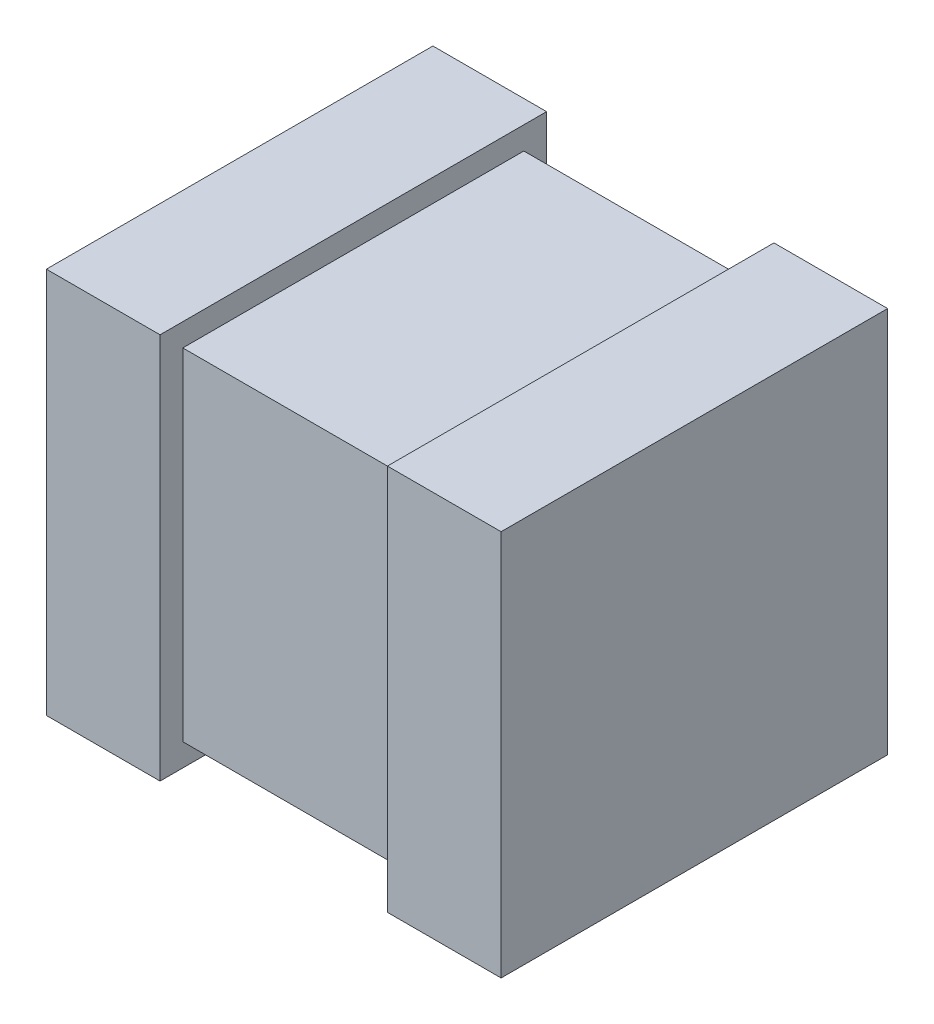
ISO-10303-21;
HEADER;
FILE_DESCRIPTION(('STEP AP214'),'2;1');
FILE_NAME('part.step','',(''),(''),'','','');
FILE_SCHEMA(('AUTOMOTIVE_DESIGN { 1 0 10303 214 1 1 1 1 }'));
ENDSEC;
DATA;
#1=APPLICATION_CONTEXT('core data for automotive mechanical design processes');
#2=APPLICATION_PROTOCOL_DEFINITION('international standard','automotive_design',2000,#1);
#3=PRODUCT_CONTEXT('',#1,'mechanical');
#4=PRODUCT('Part','Part','',(#3));
#5=PRODUCT_RELATED_PRODUCT_CATEGORY('part','',(#4));
#6=PRODUCT_DEFINITION_FORMATION('','',#4);
#7=PRODUCT_DEFINITION_CONTEXT('part definition',#1,'design');
#8=PRODUCT_DEFINITION('design','',#6,#7);
#9=PRODUCT_DEFINITION_SHAPE('','',#8);
#10=(LENGTH_UNIT() NAMED_UNIT(*) SI_UNIT(.MILLI.,.METRE.));
#11=(NAMED_UNIT(*) PLANE_ANGLE_UNIT() SI_UNIT($,.RADIAN.));
#12=(NAMED_UNIT(*) SI_UNIT($,.STERADIAN.) SOLID_ANGLE_UNIT());
#13=UNCERTAINTY_MEASURE_WITH_UNIT(LENGTH_MEASURE(1.E-05),#10,'distance_accuracy_value','');
#14=(GEOMETRIC_REPRESENTATION_CONTEXT(3) GLOBAL_UNCERTAINTY_ASSIGNED_CONTEXT((#13)) GLOBAL_UNIT_ASSIGNED_CONTEXT((#10,
#11,#12)) REPRESENTATION_CONTEXT('',''));
#15=CARTESIAN_POINT('',(0.,0.,0.));
#16=DIRECTION('',(0.,0.,1.));
#17=DIRECTION('',(1.,0.,0.));
#18=AXIS2_PLACEMENT_3D('',#15,#16,#17);
#19=CARTESIAN_POINT('',(-0.507999999999999,-0.381,0.762));
#20=DIRECTION('',(0.,1.,0.));
#21=DIRECTION('',(0.,0.,1.));
#22=AXIS2_PLACEMENT_3D('',#19,#20,#21);
#23=PLANE('',#22);
#24=DIRECTION('',(1.,0.,0.));
#25=VECTOR('',#24,1.);
#26=CARTESIAN_POINT('',(-0.507999999999999,-0.381,0.762));
#27=LINE('',#26,#25);
#28=CARTESIAN_POINT('',(-0.253999999999999,-0.381,0.762));
#29=VERTEX_POINT('',#28);
#30=CARTESIAN_POINT('',(0.254000000000001,-0.381,0.762));
#31=VERTEX_POINT('',#30);
#32=EDGE_CURVE('E214',#29,#31,#27,.T.);
#33=ORIENTED_EDGE('',*,*,#32,.F.);
#34=DIRECTION('',(0.,0.,-1.));
#35=VECTOR('',#34,1.);
#36=CARTESIAN_POINT('',(-0.253999999999999,-0.381,0.762));
#37=LINE('',#36,#35);
#38=CARTESIAN_POINT('',(-0.253999999999999,-0.381,0.));
#39=VERTEX_POINT('',#38);
#40=EDGE_CURVE('E169',#29,#39,#37,.T.);
#41=ORIENTED_EDGE('',*,*,#40,.T.);
#42=DIRECTION('',(1.,0.,0.));
#43=VECTOR('',#42,1.);
#44=CARTESIAN_POINT('',(-0.507999999999999,-0.381,0.));
#45=LINE('',#44,#43);
#46=CARTESIAN_POINT('',(0.254000000000001,-0.381,0.));
#47=VERTEX_POINT('',#46);
#48=EDGE_CURVE('E215',#39,#47,#45,.T.);
#49=ORIENTED_EDGE('',*,*,#48,.T.);
#50=DIRECTION('',(0.,0.,-1.));
#51=VECTOR('',#50,1.);
#52=CARTESIAN_POINT('',(0.254000000000001,-0.381,0.762));
#53=LINE('',#52,#51);
#54=EDGE_CURVE('E205',#31,#47,#53,.T.);
#55=ORIENTED_EDGE('',*,*,#54,.F.);
#56=EDGE_LOOP('',(#33,#41,#49,#55));
#57=FACE_BOUND('',#56,.T.);
#58=ADVANCED_FACE('F35',(#57),#23,.F.);
#59=CARTESIAN_POINT('',(0.508000000000001,0.381,0.762));
#60=DIRECTION('',(0.,-1.,0.));
#61=DIRECTION('',(1.,0.,0.));
#62=AXIS2_PLACEMENT_3D('',#59,#60,#61);
#63=PLANE('',#62);
#64=DIRECTION('',(-1.,0.,0.));
#65=VECTOR('',#64,1.);
#66=CARTESIAN_POINT('',(0.508000000000001,0.381,0.));
#67=LINE('',#66,#65);
#68=CARTESIAN_POINT('',(0.254000000000001,0.381,0.));
#69=VERTEX_POINT('',#68);
#70=CARTESIAN_POINT('',(-0.253999999999999,0.381,0.));
#71=VERTEX_POINT('',#70);
#72=EDGE_CURVE('E211',#69,#71,#67,.T.);
#73=ORIENTED_EDGE('',*,*,#72,.T.);
#74=DIRECTION('',(0.,0.,1.));
#75=VECTOR('',#74,1.);
#76=CARTESIAN_POINT('',(-0.253999999999999,0.381,0.762));
#77=LINE('',#76,#75);
#78=CARTESIAN_POINT('',(-0.253999999999999,0.381,0.762));
#79=VERTEX_POINT('',#78);
#80=EDGE_CURVE('E58',#71,#79,#77,.T.);
#81=ORIENTED_EDGE('',*,*,#80,.T.);
#82=DIRECTION('',(-1.,0.,0.));
#83=VECTOR('',#82,1.);
#84=CARTESIAN_POINT('',(0.508000000000001,0.381,0.762));
#85=LINE('',#84,#83);
#86=CARTESIAN_POINT('',(0.254000000000001,0.381,0.762));
#87=VERTEX_POINT('',#86);
#88=EDGE_CURVE('E212',#87,#79,#85,.T.);
#89=ORIENTED_EDGE('',*,*,#88,.F.);
#90=DIRECTION('',(0.,0.,1.));
#91=VECTOR('',#90,1.);
#92=CARTESIAN_POINT('',(0.254000000000001,0.381,0.762));
#93=LINE('',#92,#91);
#94=EDGE_CURVE('E203',#69,#87,#93,.T.);
#95=ORIENTED_EDGE('',*,*,#94,.F.);
#96=EDGE_LOOP('',(#73,#81,#89,#95));
#97=FACE_BOUND('',#96,.T.);
#98=ADVANCED_FACE('F227',(#97),#63,.F.);
#99=CARTESIAN_POINT('',(-0.507999999999999,-0.381,0.762));
#100=DIRECTION('',(0.,0.,-1.));
#101=DIRECTION('',(-1.,0.,0.));
#102=AXIS2_PLACEMENT_3D('',#99,#100,#101);
#103=PLANE('',#102);
#104=ORIENTED_EDGE('',*,*,#88,.T.);
#105=DIRECTION('',(0.,-1.,0.));
#106=VECTOR('',#105,1.);
#107=CARTESIAN_POINT('',(-0.253999999999999,-0.381,0.762));
#108=LINE('',#107,#106);
#109=EDGE_CURVE('E50',#79,#29,#108,.T.);
#110=ORIENTED_EDGE('',*,*,#109,.T.);
#111=ORIENTED_EDGE('',*,*,#32,.T.);
#112=DIRECTION('',(0.,-1.,0.));
#113=VECTOR('',#112,1.);
#114=CARTESIAN_POINT('',(0.254000000000001,-0.381,0.762));
#115=LINE('',#114,#113);
#116=EDGE_CURVE('E208',#87,#31,#115,.T.);
#117=ORIENTED_EDGE('',*,*,#116,.F.);
#118=EDGE_LOOP('',(#104,#110,#111,#117));
#119=FACE_BOUND('',#118,.T.);
#120=ADVANCED_FACE('F228',(#119),#103,.F.);
#121=CARTESIAN_POINT('',(-0.507999999999999,-0.381,0.));
#122=DIRECTION('',(0.,0.,-1.));
#123=DIRECTION('',(-1.,0.,0.));
#124=AXIS2_PLACEMENT_3D('',#121,#122,#123);
#125=PLANE('',#124);
#126=DIRECTION('',(0.,-1.,0.));
#127=VECTOR('',#126,1.);
#128=CARTESIAN_POINT('',(-0.253999999999999,-0.381,0.));
#129=LINE('',#128,#127);
#130=EDGE_CURVE('E11',#71,#39,#129,.T.);
#131=ORIENTED_EDGE('',*,*,#130,.F.);
#132=ORIENTED_EDGE('',*,*,#72,.F.);
#133=DIRECTION('',(0.,-1.,0.));
#134=VECTOR('',#133,1.);
#135=CARTESIAN_POINT('',(0.254000000000001,-0.381,0.));
#136=LINE('',#135,#134);
#137=EDGE_CURVE('E43',#69,#47,#136,.T.);
#138=ORIENTED_EDGE('',*,*,#137,.T.);
#139=ORIENTED_EDGE('',*,*,#48,.F.);
#140=EDGE_LOOP('',(#131,#132,#138,#139));
#141=FACE_BOUND('',#140,.T.);
#142=ADVANCED_FACE('F221',(#141),#125,.T.);
#143=CARTESIAN_POINT('',(0.254000000000001,0.4318,0.8128));
#144=DIRECTION('',(1.,0.,0.));
#145=DIRECTION('',(0.,0.,-1.));
#146=AXIS2_PLACEMENT_3D('',#143,#144,#145);
#147=PLANE('',#146);
#148=DIRECTION('',(0.,1.,0.));
#149=VECTOR('',#148,1.);
#150=CARTESIAN_POINT('',(0.254000000000001,-0.4318,0.8128));
#151=LINE('',#150,#149);
#152=CARTESIAN_POINT('',(0.254000000000001,-0.4318,0.8128));
#153=VERTEX_POINT('',#152);
#154=CARTESIAN_POINT('',(0.254000000000001,0.4318,0.8128));
#155=VERTEX_POINT('',#154);
#156=EDGE_CURVE('E174',#153,#155,#151,.T.);
#157=ORIENTED_EDGE('',*,*,#156,.T.);
#158=DIRECTION('',(0.,0.,1.));
#159=VECTOR('',#158,1.);
#160=CARTESIAN_POINT('',(0.254000000000001,0.4318,-0.0508000000000003));
#161=LINE('',#160,#159);
#162=CARTESIAN_POINT('',(0.254000000000001,0.4318,-0.0508000000000003));
#163=VERTEX_POINT('',#162);
#164=EDGE_CURVE('E176',#163,#155,#161,.T.);
#165=ORIENTED_EDGE('',*,*,#164,.F.);
#166=DIRECTION('',(0.,-1.,0.));
#167=VECTOR('',#166,1.);
#168=CARTESIAN_POINT('',(0.254000000000001,0.4318,-0.0508000000000003));
#169=LINE('',#168,#167);
#170=CARTESIAN_POINT('',(0.254000000000001,-0.4318,-0.0508000000000005));
#171=VERTEX_POINT('',#170);
#172=EDGE_CURVE('E180',#163,#171,#169,.T.);
#173=ORIENTED_EDGE('',*,*,#172,.T.);
#174=DIRECTION('',(0.,0.,-1.));
#175=VECTOR('',#174,1.);
#176=CARTESIAN_POINT('',(0.254000000000001,-0.4318,0.8128));
#177=LINE('',#176,#175);
#178=EDGE_CURVE('E182',#153,#171,#177,.T.);
#179=ORIENTED_EDGE('',*,*,#178,.F.);
#180=EDGE_LOOP('',(#157,#165,#173,#179));
#181=FACE_BOUND('',#180,.T.);
#182=ORIENTED_EDGE('',*,*,#94,.T.);
#183=ORIENTED_EDGE('',*,*,#116,.T.);
#184=ORIENTED_EDGE('',*,*,#54,.T.);
#185=ORIENTED_EDGE('',*,*,#137,.F.);
#186=EDGE_LOOP('',(#182,#183,#184,#185));
#187=FACE_BOUND('',#186,.T.);
#188=ADVANCED_FACE('F224',(#181,#187),#147,.F.);
#189=CARTESIAN_POINT('',(0.254000000000001,-0.4318,0.8128));
#190=DIRECTION('',(0.,0.,-1.));
#191=DIRECTION('',(-1.,0.,0.));
#192=AXIS2_PLACEMENT_3D('',#189,#190,#191);
#193=PLANE('',#192);
#194=DIRECTION('',(0.,1.,0.));
#195=VECTOR('',#194,1.);
#196=CARTESIAN_POINT('',(0.508000000000001,-0.4318,0.8128));
#197=LINE('',#196,#195);
#198=CARTESIAN_POINT('',(0.508000000000001,-0.4318,0.8128));
#199=VERTEX_POINT('',#198);
#200=CARTESIAN_POINT('',(0.508000000000001,0.4318,0.8128));
#201=VERTEX_POINT('',#200);
#202=EDGE_CURVE('E173',#199,#201,#197,.T.);
#203=ORIENTED_EDGE('',*,*,#202,.T.);
#204=DIRECTION('',(1.,0.,0.));
#205=VECTOR('',#204,1.);
#206=CARTESIAN_POINT('',(0.254000000000001,0.4318,0.8128));
#207=LINE('',#206,#205);
#208=EDGE_CURVE('E201',#155,#201,#207,.T.);
#209=ORIENTED_EDGE('',*,*,#208,.F.);
#210=ORIENTED_EDGE('',*,*,#156,.F.);
#211=DIRECTION('',(1.,0.,0.));
#212=VECTOR('',#211,1.);
#213=CARTESIAN_POINT('',(0.254000000000001,-0.4318,0.8128));
#214=LINE('',#213,#212);
#215=EDGE_CURVE('E185',#153,#199,#214,.T.);
#216=ORIENTED_EDGE('',*,*,#215,.T.);
#217=EDGE_LOOP('',(#203,#209,#210,#216));
#218=FACE_BOUND('',#217,.T.);
#219=ADVANCED_FACE('F265',(#218),#193,.F.);
#220=CARTESIAN_POINT('',(0.254000000000001,0.4318,-0.0508000000000003));
#221=DIRECTION('',(0.,1.,0.));
#222=DIRECTION('',(0.,0.,1.));
#223=AXIS2_PLACEMENT_3D('',#220,#221,#222);
#224=PLANE('',#223);
#225=DIRECTION('',(0.,0.,1.));
#226=VECTOR('',#225,1.);
#227=CARTESIAN_POINT('',(0.508000000000001,0.4318,-0.0508000000000003));
#228=LINE('',#227,#226);
#229=CARTESIAN_POINT('',(0.508000000000001,0.4318,-0.0508000000000003));
#230=VERTEX_POINT('',#229);
#231=EDGE_CURVE('E188',#230,#201,#228,.T.);
#232=ORIENTED_EDGE('',*,*,#231,.F.);
#233=DIRECTION('',(1.,0.,0.));
#234=VECTOR('',#233,1.);
#235=CARTESIAN_POINT('',(0.254000000000001,0.4318,-0.0508000000000003));
#236=LINE('',#235,#234);
#237=EDGE_CURVE('E199',#163,#230,#236,.T.);
#238=ORIENTED_EDGE('',*,*,#237,.F.);
#239=ORIENTED_EDGE('',*,*,#164,.T.);
#240=ORIENTED_EDGE('',*,*,#208,.T.);
#241=EDGE_LOOP('',(#232,#238,#239,#240));
#242=FACE_BOUND('',#241,.T.);
#243=ADVANCED_FACE('F263',(#242),#224,.T.);
#244=CARTESIAN_POINT('',(0.254000000000001,0.4318,-0.0508000000000003));
#245=DIRECTION('',(0.,0.,1.));
#246=DIRECTION('',(0.,-1.,0.));
#247=AXIS2_PLACEMENT_3D('',#244,#245,#246);
#248=PLANE('',#247);
#249=DIRECTION('',(0.,-1.,0.));
#250=VECTOR('',#249,1.);
#251=CARTESIAN_POINT('',(0.508000000000001,0.4318,-0.0508000000000003));
#252=LINE('',#251,#250);
#253=CARTESIAN_POINT('',(0.508000000000001,-0.4318,-0.0508000000000005));
#254=VERTEX_POINT('',#253);
#255=EDGE_CURVE('E191',#230,#254,#252,.T.);
#256=ORIENTED_EDGE('',*,*,#255,.T.);
#257=DIRECTION('',(1.,0.,0.));
#258=VECTOR('',#257,1.);
#259=CARTESIAN_POINT('',(0.254000000000001,-0.4318,-0.0508000000000005));
#260=LINE('',#259,#258);
#261=EDGE_CURVE('E197',#171,#254,#260,.T.);
#262=ORIENTED_EDGE('',*,*,#261,.F.);
#263=ORIENTED_EDGE('',*,*,#172,.F.);
#264=ORIENTED_EDGE('',*,*,#237,.T.);
#265=EDGE_LOOP('',(#256,#262,#263,#264));
#266=FACE_BOUND('',#265,.T.);
#267=ADVANCED_FACE('F248',(#266),#248,.F.);
#268=CARTESIAN_POINT('',(0.254000000000001,-0.4318,0.8128));
#269=DIRECTION('',(0.,-1.,0.));
#270=DIRECTION('',(0.,0.,-1.));
#271=AXIS2_PLACEMENT_3D('',#268,#269,#270);
#272=PLANE('',#271);
#273=DIRECTION('',(0.,0.,-1.));
#274=VECTOR('',#273,1.);
#275=CARTESIAN_POINT('',(0.508000000000001,-0.4318,0.8128));
#276=LINE('',#275,#274);
#277=EDGE_CURVE('E177',#199,#254,#276,.T.);
#278=ORIENTED_EDGE('',*,*,#277,.F.);
#279=ORIENTED_EDGE('',*,*,#215,.F.);
#280=ORIENTED_EDGE('',*,*,#178,.T.);
#281=ORIENTED_EDGE('',*,*,#261,.T.);
#282=EDGE_LOOP('',(#278,#279,#280,#281));
#283=FACE_BOUND('',#282,.T.);
#284=ADVANCED_FACE('F241',(#283),#272,.T.);
#285=CARTESIAN_POINT('',(0.508000000000001,0.381,0.762));
#286=DIRECTION('',(1.,0.,0.));
#287=DIRECTION('',(0.,1.,0.));
#288=AXIS2_PLACEMENT_3D('',#285,#286,#287);
#289=PLANE('',#288);
#290=ORIENTED_EDGE('',*,*,#202,.F.);
#291=ORIENTED_EDGE('',*,*,#277,.T.);
#292=ORIENTED_EDGE('',*,*,#255,.F.);
#293=ORIENTED_EDGE('',*,*,#231,.T.);
#294=EDGE_LOOP('',(#290,#291,#292,#293));
#295=FACE_BOUND('',#294,.T.);
#296=ADVANCED_FACE('F239',(#295),#289,.T.);
#297=CARTESIAN_POINT('',(-0.253999999999999,-0.4318,-0.0508000000000002));
#298=DIRECTION('',(1.,0.,0.));
#299=DIRECTION('',(0.,0.,-1.));
#300=AXIS2_PLACEMENT_3D('',#297,#298,#299);
#301=PLANE('',#300);
#302=DIRECTION('',(0.,-1.,0.));
#303=VECTOR('',#302,1.);
#304=CARTESIAN_POINT('',(-0.253999999999999,0.4318,-0.0508000000000003));
#305=LINE('',#304,#303);
#306=CARTESIAN_POINT('',(-0.253999999999999,0.4318,-0.0508000000000003));
#307=VERTEX_POINT('',#306);
#308=CARTESIAN_POINT('',(-0.253999999999999,-0.4318,-0.0508000000000002));
#309=VERTEX_POINT('',#308);
#310=EDGE_CURVE('E132',#307,#309,#305,.T.);
#311=ORIENTED_EDGE('',*,*,#310,.F.);
#312=DIRECTION('',(0.,0.,1.));
#313=VECTOR('',#312,1.);
#314=CARTESIAN_POINT('',(-0.253999999999999,0.4318,-0.0508000000000003));
#315=LINE('',#314,#313);
#316=CARTESIAN_POINT('',(-0.253999999999999,0.4318,0.8128));
#317=VERTEX_POINT('',#316);
#318=EDGE_CURVE('E146',#307,#317,#315,.T.);
#319=ORIENTED_EDGE('',*,*,#318,.T.);
#320=DIRECTION('',(0.,1.,0.));
#321=VECTOR('',#320,1.);
#322=CARTESIAN_POINT('',(-0.253999999999999,-0.4318,0.8128));
#323=LINE('',#322,#321);
#324=CARTESIAN_POINT('',(-0.253999999999999,-0.4318,0.8128));
#325=VERTEX_POINT('',#324);
#326=EDGE_CURVE('E134',#325,#317,#323,.T.);
#327=ORIENTED_EDGE('',*,*,#326,.F.);
#328=DIRECTION('',(0.,0.,-1.));
#329=VECTOR('',#328,1.);
#330=CARTESIAN_POINT('',(-0.253999999999999,-0.4318,0.8128));
#331=LINE('',#330,#329);
#332=EDGE_CURVE('E127',#325,#309,#331,.T.);
#333=ORIENTED_EDGE('',*,*,#332,.T.);
#334=EDGE_LOOP('',(#311,#319,#327,#333));
#335=FACE_BOUND('',#334,.T.);
#336=ORIENTED_EDGE('',*,*,#109,.F.);
#337=ORIENTED_EDGE('',*,*,#80,.F.);
#338=ORIENTED_EDGE('',*,*,#130,.T.);
#339=ORIENTED_EDGE('',*,*,#40,.F.);
#340=EDGE_LOOP('',(#336,#337,#338,#339));
#341=FACE_BOUND('',#340,.T.);
#342=ADVANCED_FACE('F129',(#335,#341),#301,.T.);
#343=CARTESIAN_POINT('',(-0.253999999999999,0.4318,-0.0508000000000003));
#344=DIRECTION('',(0.,0.,-1.));
#345=DIRECTION('',(0.,1.,0.));
#346=AXIS2_PLACEMENT_3D('',#343,#344,#345);
#347=PLANE('',#346);
#348=DIRECTION('',(0.,-1.,0.));
#349=VECTOR('',#348,1.);
#350=CARTESIAN_POINT('',(-0.507999999999999,0.4318,-0.0508000000000003));
#351=LINE('',#350,#349);
#352=CARTESIAN_POINT('',(-0.507999999999999,0.4318,-0.0508000000000003));
#353=VERTEX_POINT('',#352);
#354=CARTESIAN_POINT('',(-0.507999999999999,-0.4318,-0.0508000000000002));
#355=VERTEX_POINT('',#354);
#356=EDGE_CURVE('E159',#353,#355,#351,.T.);
#357=ORIENTED_EDGE('',*,*,#356,.F.);
#358=DIRECTION('',(-1.,0.,0.));
#359=VECTOR('',#358,1.);
#360=CARTESIAN_POINT('',(-0.253999999999999,0.4318,-0.0508000000000003));
#361=LINE('',#360,#359);
#362=EDGE_CURVE('E149',#307,#353,#361,.T.);
#363=ORIENTED_EDGE('',*,*,#362,.F.);
#364=ORIENTED_EDGE('',*,*,#310,.T.);
#365=DIRECTION('',(-1.,0.,0.));
#366=VECTOR('',#365,1.);
#367=CARTESIAN_POINT('',(-0.253999999999999,-0.4318,-0.0508000000000002));
#368=LINE('',#367,#366);
#369=EDGE_CURVE('E138',#309,#355,#368,.T.);
#370=ORIENTED_EDGE('',*,*,#369,.T.);
#371=EDGE_LOOP('',(#357,#363,#364,#370));
#372=FACE_BOUND('',#371,.T.);
#373=ADVANCED_FACE('F148',(#372),#347,.T.);
#374=CARTESIAN_POINT('',(-0.253999999999999,0.4318,-0.0508000000000003));
#375=DIRECTION('',(0.,-1.,0.));
#376=DIRECTION('',(0.,0.,-1.));
#377=AXIS2_PLACEMENT_3D('',#374,#375,#376);
#378=PLANE('',#377);
#379=DIRECTION('',(0.,0.,1.));
#380=VECTOR('',#379,1.);
#381=CARTESIAN_POINT('',(-0.507999999999999,0.4318,-0.0508000000000003));
#382=LINE('',#381,#380);
#383=CARTESIAN_POINT('',(-0.507999999999999,0.4318,0.8128));
#384=VERTEX_POINT('',#383);
#385=EDGE_CURVE('E151',#353,#384,#382,.T.);
#386=ORIENTED_EDGE('',*,*,#385,.T.);
#387=DIRECTION('',(-1.,0.,0.));
#388=VECTOR('',#387,1.);
#389=CARTESIAN_POINT('',(-0.253999999999999,0.4318,0.8128));
#390=LINE('',#389,#388);
#391=EDGE_CURVE('E165',#317,#384,#390,.T.);
#392=ORIENTED_EDGE('',*,*,#391,.F.);
#393=ORIENTED_EDGE('',*,*,#318,.F.);
#394=ORIENTED_EDGE('',*,*,#362,.T.);
#395=EDGE_LOOP('',(#386,#392,#393,#394));
#396=FACE_BOUND('',#395,.T.);
#397=ADVANCED_FACE('F308',(#396),#378,.F.);
#398=CARTESIAN_POINT('',(-0.253999999999999,-0.4318,0.8128));
#399=DIRECTION('',(0.,0.,1.));
#400=DIRECTION('',(1.,0.,0.));
#401=AXIS2_PLACEMENT_3D('',#398,#399,#400);
#402=PLANE('',#401);
#403=DIRECTION('',(0.,1.,0.));
#404=VECTOR('',#403,1.);
#405=CARTESIAN_POINT('',(-0.507999999999999,-0.4318,0.8128));
#406=LINE('',#405,#404);
#407=CARTESIAN_POINT('',(-0.507999999999999,-0.4318,0.8128));
#408=VERTEX_POINT('',#407);
#409=EDGE_CURVE('E154',#408,#384,#406,.T.);
#410=ORIENTED_EDGE('',*,*,#409,.F.);
#411=DIRECTION('',(-1.,0.,0.));
#412=VECTOR('',#411,1.);
#413=CARTESIAN_POINT('',(-0.253999999999999,-0.4318,0.8128));
#414=LINE('',#413,#412);
#415=EDGE_CURVE('E145',#325,#408,#414,.T.);
#416=ORIENTED_EDGE('',*,*,#415,.F.);
#417=ORIENTED_EDGE('',*,*,#326,.T.);
#418=ORIENTED_EDGE('',*,*,#391,.T.);
#419=EDGE_LOOP('',(#410,#416,#417,#418));
#420=FACE_BOUND('',#419,.T.);
#421=ADVANCED_FACE('F319',(#420),#402,.T.);
#422=CARTESIAN_POINT('',(-0.253999999999999,-0.4318,0.8128));
#423=DIRECTION('',(0.,1.,0.));
#424=DIRECTION('',(0.,0.,1.));
#425=AXIS2_PLACEMENT_3D('',#422,#423,#424);
#426=PLANE('',#425);
#427=DIRECTION('',(0.,0.,-1.));
#428=VECTOR('',#427,1.);
#429=CARTESIAN_POINT('',(-0.507999999999999,-0.4318,0.8128));
#430=LINE('',#429,#428);
#431=EDGE_CURVE('E141',#408,#355,#430,.T.);
#432=ORIENTED_EDGE('',*,*,#431,.T.);
#433=ORIENTED_EDGE('',*,*,#369,.F.);
#434=ORIENTED_EDGE('',*,*,#332,.F.);
#435=ORIENTED_EDGE('',*,*,#415,.T.);
#436=EDGE_LOOP('',(#432,#433,#434,#435));
#437=FACE_BOUND('',#436,.T.);
#438=ADVANCED_FACE('F139',(#437),#426,.F.);
#439=CARTESIAN_POINT('',(-0.507999999999999,-0.381,0.762));
#440=DIRECTION('',(-1.,0.,0.));
#441=DIRECTION('',(0.,0.,1.));
#442=AXIS2_PLACEMENT_3D('',#439,#440,#441);
#443=PLANE('',#442);
#444=ORIENTED_EDGE('',*,*,#356,.T.);
#445=ORIENTED_EDGE('',*,*,#431,.F.);
#446=ORIENTED_EDGE('',*,*,#409,.T.);
#447=ORIENTED_EDGE('',*,*,#385,.F.);
#448=EDGE_LOOP('',(#444,#445,#446,#447));
#449=FACE_BOUND('',#448,.T.);
#450=ADVANCED_FACE('F37',(#449),#443,.T.);
#451=CLOSED_SHELL('',(#58,#98,#120,#142,#188,#219,#243,#267,#284,#296,#342,#373,#397,#421,#438,#450));
#452=MANIFOLD_SOLID_BREP('B2',#451);
#453=ADVANCED_BREP_SHAPE_REPRESENTATION('',(#18,#452),#14);
#454=SHAPE_DEFINITION_REPRESENTATION(#9,#453);
ENDSEC;
END-ISO-10303-21;
